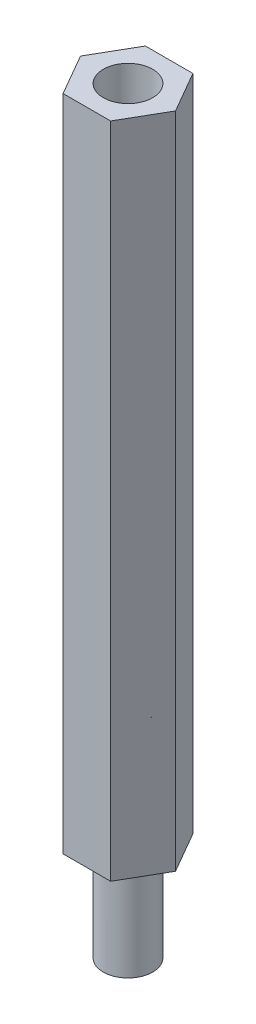
ISO-10303-21;
HEADER;
FILE_DESCRIPTION(('STEP AP214'),'2;1');
FILE_NAME('part.step','',(''),(''),'','','');
FILE_SCHEMA(('AUTOMOTIVE_DESIGN { 1 0 10303 214 1 1 1 1 }'));
ENDSEC;
DATA;
#1=APPLICATION_CONTEXT('core data for automotive mechanical design processes');
#2=APPLICATION_PROTOCOL_DEFINITION('international standard','automotive_design',2000,#1);
#3=PRODUCT_CONTEXT('',#1,'mechanical');
#4=PRODUCT('Part','Part','',(#3));
#5=PRODUCT_RELATED_PRODUCT_CATEGORY('part','',(#4));
#6=PRODUCT_DEFINITION_FORMATION('','',#4);
#7=PRODUCT_DEFINITION_CONTEXT('part definition',#1,'design');
#8=PRODUCT_DEFINITION('design','',#6,#7);
#9=PRODUCT_DEFINITION_SHAPE('','',#8);
#10=(LENGTH_UNIT() NAMED_UNIT(*) SI_UNIT(.MILLI.,.METRE.));
#11=(NAMED_UNIT(*) PLANE_ANGLE_UNIT() SI_UNIT($,.RADIAN.));
#12=(NAMED_UNIT(*) SI_UNIT($,.STERADIAN.) SOLID_ANGLE_UNIT());
#13=UNCERTAINTY_MEASURE_WITH_UNIT(LENGTH_MEASURE(1.E-05),#10,'distance_accuracy_value','');
#14=(GEOMETRIC_REPRESENTATION_CONTEXT(3) GLOBAL_UNCERTAINTY_ASSIGNED_CONTEXT((#13)) GLOBAL_UNIT_ASSIGNED_CONTEXT((#10,
#11,#12)) REPRESENTATION_CONTEXT('',''));
#15=CARTESIAN_POINT('',(0.,0.,0.));
#16=DIRECTION('',(0.,0.,1.));
#17=DIRECTION('',(1.,0.,0.));
#18=AXIS2_PLACEMENT_3D('',#15,#16,#17);
#19=CARTESIAN_POINT('',(-118.553263391177,736.792319552453,160.917570962768));
#20=DIRECTION('',(0.,1.,0.));
#21=DIRECTION('',(0.,0.,-1.));
#22=AXIS2_PLACEMENT_3D('',#19,#20,#21);
#23=CYLINDRICAL_SURFACE('',#22,1.);
#24=CARTESIAN_POINT('',(-118.553263391177,729.292319552453,160.917570962768));
#25=DIRECTION('',(0.,-1.,0.));
#26=DIRECTION('',(0.,0.,-1.));
#27=AXIS2_PLACEMENT_3D('',#24,#25,#26);
#28=CIRCLE('',#27,1.);
#29=CARTESIAN_POINT('',(-118.553263391177,729.292319552453,159.917570962768));
#30=VERTEX_POINT('',#29);
#31=EDGE_CURVE('E201',#30,#30,#28,.F.);
#32=ORIENTED_EDGE('',*,*,#31,.F.);
#33=EDGE_LOOP('',(#32));
#34=FACE_BOUND('',#33,.T.);
#35=CARTESIAN_POINT('',(-118.553263391177,749.292319552453,160.917570962768));
#36=DIRECTION('',(0.,1.,0.));
#37=DIRECTION('',(0.,0.,1.));
#38=AXIS2_PLACEMENT_3D('',#35,#36,#37);
#39=CIRCLE('',#38,1.);
#40=CARTESIAN_POINT('',(-118.553263391177,749.292319552453,161.917570962768));
#41=VERTEX_POINT('',#40);
#42=EDGE_CURVE('E118',#41,#41,#39,.F.);
#43=ORIENTED_EDGE('',*,*,#42,.F.);
#44=EDGE_LOOP('',(#43));
#45=FACE_BOUND('',#44,.T.);
#46=ADVANCED_FACE('F34',(#34,#45),#23,.F.);
#47=CARTESIAN_POINT('',(-117.109887718177,744.292319552453,163.417570962768));
#48=DIRECTION('',(-0.866025403838329,0.,-0.499999999906659));
#49=DIRECTION('',(-0.499999999906659,0.,0.866025403838329));
#50=AXIS2_PLACEMENT_3D('',#47,#48,#49);
#51=PLANE('',#50);
#52=DIRECTION('',(0.500000000006738,0.,-0.866025403780548));
#53=VECTOR('',#52,1.);
#54=CARTESIAN_POINT('',(-117.109887718177,729.292319552453,163.417570962768));
#55=LINE('',#54,#53);
#56=CARTESIAN_POINT('',(-117.109887718177,729.292319552453,163.417570962768));
#57=VERTEX_POINT('',#56);
#58=CARTESIAN_POINT('',(-115.666512045177,729.292319552453,160.917570962768));
#59=VERTEX_POINT('',#58);
#60=EDGE_CURVE('E43',#57,#59,#55,.T.);
#61=ORIENTED_EDGE('',*,*,#60,.T.);
#62=DIRECTION('',(0.,-1.,0.));
#63=VECTOR('',#62,1.);
#64=CARTESIAN_POINT('',(-115.666512045177,744.292319552453,160.917570962768));
#65=LINE('',#64,#63);
#66=CARTESIAN_POINT('',(-115.666512045177,769.292319552453,160.917570962768));
#67=VERTEX_POINT('',#66);
#68=EDGE_CURVE('E51',#67,#59,#65,.T.);
#69=ORIENTED_EDGE('',*,*,#68,.F.);
#70=DIRECTION('',(0.500000000006738,0.,-0.866025403780549));
#71=VECTOR('',#70,1.);
#72=CARTESIAN_POINT('',(-117.109887718177,769.292319552453,163.417570962768));
#73=LINE('',#72,#71);
#74=CARTESIAN_POINT('',(-117.109887718177,769.292319552453,163.417570962768));
#75=VERTEX_POINT('',#74);
#76=EDGE_CURVE('E108',#75,#67,#73,.T.);
#77=ORIENTED_EDGE('',*,*,#76,.F.);
#78=DIRECTION('',(0.,-1.,0.));
#79=VECTOR('',#78,1.);
#80=CARTESIAN_POINT('',(-117.109887718177,744.292319552453,163.417570962768));
#81=LINE('',#80,#79);
#82=EDGE_CURVE('E96',#75,#57,#81,.T.);
#83=ORIENTED_EDGE('',*,*,#82,.T.);
#84=EDGE_LOOP('',(#61,#69,#77,#83));
#85=FACE_BOUND('',#84,.T.);
#86=ADVANCED_FACE('F109',(#85),#51,.F.);
#87=CARTESIAN_POINT('',(-115.666512045177,744.292319552453,160.917570962768));
#88=DIRECTION('',(-0.866025403838329,0.,0.499999999906659));
#89=DIRECTION('',(0.499999999906659,0.,0.866025403838329));
#90=AXIS2_PLACEMENT_3D('',#87,#88,#89);
#91=PLANE('',#90);
#92=DIRECTION('',(-0.500000000006738,0.,-0.866025403780548));
#93=VECTOR('',#92,1.);
#94=CARTESIAN_POINT('',(-115.666512045177,729.292319552453,160.917570962768));
#95=LINE('',#94,#93);
#96=CARTESIAN_POINT('',(-117.109887718177,729.292319552453,158.417570962768));
#97=VERTEX_POINT('',#96);
#98=EDGE_CURVE('E105',#59,#97,#95,.T.);
#99=ORIENTED_EDGE('',*,*,#98,.T.);
#100=DIRECTION('',(0.,-1.,0.));
#101=VECTOR('',#100,1.);
#102=CARTESIAN_POINT('',(-117.109887718177,744.292319552453,158.417570962768));
#103=LINE('',#102,#101);
#104=CARTESIAN_POINT('',(-117.109887718177,769.292319552453,158.417570962768));
#105=VERTEX_POINT('',#104);
#106=EDGE_CURVE('E67',#105,#97,#103,.T.);
#107=ORIENTED_EDGE('',*,*,#106,.F.);
#108=DIRECTION('',(-0.500000000006738,0.,-0.866025403780549));
#109=VECTOR('',#108,1.);
#110=CARTESIAN_POINT('',(-115.666512045177,769.292319552453,160.917570962768));
#111=LINE('',#110,#109);
#112=EDGE_CURVE('E112',#67,#105,#111,.T.);
#113=ORIENTED_EDGE('',*,*,#112,.F.);
#114=ORIENTED_EDGE('',*,*,#68,.T.);
#115=EDGE_LOOP('',(#99,#107,#113,#114));
#116=FACE_BOUND('',#115,.T.);
#117=ADVANCED_FACE('F168',(#116),#91,.F.);
#118=CARTESIAN_POINT('',(-117.109887718177,744.292319552453,158.417570962768));
#119=DIRECTION('',(0.,0.,1.));
#120=DIRECTION('',(1.,0.,0.));
#121=AXIS2_PLACEMENT_3D('',#118,#119,#120);
#122=PLANE('',#121);
#123=DIRECTION('',(-1.,0.,0.));
#124=VECTOR('',#123,1.);
#125=CARTESIAN_POINT('',(-117.109887718177,729.292319552453,158.417570962768));
#126=LINE('',#125,#124);
#127=CARTESIAN_POINT('',(-119.996639064177,729.292319552453,158.417570962768));
#128=VERTEX_POINT('',#127);
#129=EDGE_CURVE('E135',#97,#128,#126,.T.);
#130=ORIENTED_EDGE('',*,*,#129,.T.);
#131=DIRECTION('',(0.,-1.,0.));
#132=VECTOR('',#131,1.);
#133=CARTESIAN_POINT('',(-119.996639064177,744.292319552453,158.417570962768));
#134=LINE('',#133,#132);
#135=CARTESIAN_POINT('',(-119.996639064177,769.292319552453,158.417570962768));
#136=VERTEX_POINT('',#135);
#137=EDGE_CURVE('E73',#136,#128,#134,.T.);
#138=ORIENTED_EDGE('',*,*,#137,.F.);
#139=DIRECTION('',(-1.,0.,0.));
#140=VECTOR('',#139,1.);
#141=CARTESIAN_POINT('',(-117.109887718177,769.292319552453,158.417570962768));
#142=LINE('',#141,#140);
#143=EDGE_CURVE('E127',#105,#136,#142,.T.);
#144=ORIENTED_EDGE('',*,*,#143,.F.);
#145=ORIENTED_EDGE('',*,*,#106,.T.);
#146=EDGE_LOOP('',(#130,#138,#144,#145));
#147=FACE_BOUND('',#146,.T.);
#148=ADVANCED_FACE('F159',(#147),#122,.F.);
#149=CARTESIAN_POINT('',(-119.996639064177,744.292319552453,158.417570962768));
#150=DIRECTION('',(0.866025403838329,0.,0.499999999906659));
#151=DIRECTION('',(0.499999999906659,0.,-0.866025403838329));
#152=AXIS2_PLACEMENT_3D('',#149,#150,#151);
#153=PLANE('',#152);
#154=DIRECTION('',(-0.500000000006738,0.,0.866025403780548));
#155=VECTOR('',#154,1.);
#156=CARTESIAN_POINT('',(-119.996639064177,729.292319552453,158.417570962768));
#157=LINE('',#156,#155);
#158=CARTESIAN_POINT('',(-121.440014737177,729.292319552453,160.917570962768));
#159=VERTEX_POINT('',#158);
#160=EDGE_CURVE('E142',#128,#159,#157,.T.);
#161=ORIENTED_EDGE('',*,*,#160,.T.);
#162=DIRECTION('',(0.,-1.,0.));
#163=VECTOR('',#162,1.);
#164=CARTESIAN_POINT('',(-121.440014737177,744.292319552453,160.917570962768));
#165=LINE('',#164,#163);
#166=CARTESIAN_POINT('',(-121.440014737177,769.292319552453,160.917570962768));
#167=VERTEX_POINT('',#166);
#168=EDGE_CURVE('E79',#167,#159,#165,.T.);
#169=ORIENTED_EDGE('',*,*,#168,.F.);
#170=DIRECTION('',(-0.500000000006738,0.,0.866025403780549));
#171=VECTOR('',#170,1.);
#172=CARTESIAN_POINT('',(-119.996639064177,769.292319552453,158.417570962768));
#173=LINE('',#172,#171);
#174=EDGE_CURVE('E130',#136,#167,#173,.T.);
#175=ORIENTED_EDGE('',*,*,#174,.F.);
#176=ORIENTED_EDGE('',*,*,#137,.T.);
#177=EDGE_LOOP('',(#161,#169,#175,#176));
#178=FACE_BOUND('',#177,.T.);
#179=ADVANCED_FACE('F149',(#178),#153,.F.);
#180=CARTESIAN_POINT('',(-121.440014737177,744.292319552453,160.917570962768));
#181=DIRECTION('',(0.866025403838329,0.,-0.499999999906659));
#182=DIRECTION('',(-0.499999999906659,0.,-0.866025403838329));
#183=AXIS2_PLACEMENT_3D('',#180,#181,#182);
#184=PLANE('',#183);
#185=DIRECTION('',(0.500000000006738,0.,0.866025403780548));
#186=VECTOR('',#185,1.);
#187=CARTESIAN_POINT('',(-121.440014737177,729.292319552453,160.917570962768));
#188=LINE('',#187,#186);
#189=CARTESIAN_POINT('',(-119.996639064177,729.292319552453,163.417570962768));
#190=VERTEX_POINT('',#189);
#191=EDGE_CURVE('E137',#159,#190,#188,.T.);
#192=ORIENTED_EDGE('',*,*,#191,.T.);
#193=DIRECTION('',(0.,-1.,0.));
#194=VECTOR('',#193,1.);
#195=CARTESIAN_POINT('',(-119.996639064177,744.292319552453,163.417570962768));
#196=LINE('',#195,#194);
#197=CARTESIAN_POINT('',(-119.996639064177,769.292319552453,163.417570962768));
#198=VERTEX_POINT('',#197);
#199=EDGE_CURVE('E133',#198,#190,#196,.T.);
#200=ORIENTED_EDGE('',*,*,#199,.F.);
#201=DIRECTION('',(0.500000000006738,0.,0.866025403780549));
#202=VECTOR('',#201,1.);
#203=CARTESIAN_POINT('',(-121.440014737177,769.292319552453,160.917570962768));
#204=LINE('',#203,#202);
#205=EDGE_CURVE('E117',#167,#198,#204,.T.);
#206=ORIENTED_EDGE('',*,*,#205,.F.);
#207=ORIENTED_EDGE('',*,*,#168,.T.);
#208=EDGE_LOOP('',(#192,#200,#206,#207));
#209=FACE_BOUND('',#208,.T.);
#210=ADVANCED_FACE('F152',(#209),#184,.F.);
#211=CARTESIAN_POINT('',(-119.996639064177,744.292319552453,163.417570962768));
#212=DIRECTION('',(0.,0.,-1.));
#213=DIRECTION('',(-1.,0.,0.));
#214=AXIS2_PLACEMENT_3D('',#211,#212,#213);
#215=PLANE('',#214);
#216=DIRECTION('',(1.,0.,0.));
#217=VECTOR('',#216,1.);
#218=CARTESIAN_POINT('',(-119.996639064177,729.292319552453,163.417570962768));
#219=LINE('',#218,#217);
#220=EDGE_CURVE('E102',#190,#57,#219,.T.);
#221=ORIENTED_EDGE('',*,*,#220,.T.);
#222=ORIENTED_EDGE('',*,*,#82,.F.);
#223=DIRECTION('',(1.,0.,0.));
#224=VECTOR('',#223,1.);
#225=CARTESIAN_POINT('',(-119.996639064177,769.292319552453,163.417570962768));
#226=LINE('',#225,#224);
#227=EDGE_CURVE('E100',#198,#75,#226,.T.);
#228=ORIENTED_EDGE('',*,*,#227,.F.);
#229=ORIENTED_EDGE('',*,*,#199,.T.);
#230=EDGE_LOOP('',(#221,#222,#228,#229));
#231=FACE_BOUND('',#230,.T.);
#232=ADVANCED_FACE('F98',(#231),#215,.F.);
#233=CARTESIAN_POINT('',(-118.553263391177,729.292319552453,160.917570962768));
#234=DIRECTION('',(0.,1.,0.));
#235=DIRECTION('',(0.,0.,1.));
#236=AXIS2_PLACEMENT_3D('',#233,#234,#235);
#237=PLANE('',#236);
#238=CARTESIAN_POINT('',(-118.553263391177,729.292319552453,160.917570962768));
#239=DIRECTION('',(0.,1.,0.));
#240=DIRECTION('',(0.,0.,1.));
#241=AXIS2_PLACEMENT_3D('',#238,#239,#240);
#242=CIRCLE('',#241,1.5);
#243=CARTESIAN_POINT('',(-118.553263391177,729.292319552453,162.417570962768));
#244=VERTEX_POINT('',#243);
#245=EDGE_CURVE('E11',#244,#244,#242,.F.);
#246=ORIENTED_EDGE('',*,*,#245,.F.);
#247=EDGE_LOOP('',(#246));
#248=FACE_BOUND('',#247,.T.);
#249=ORIENTED_EDGE('',*,*,#60,.F.);
#250=ORIENTED_EDGE('',*,*,#220,.F.);
#251=ORIENTED_EDGE('',*,*,#191,.F.);
#252=ORIENTED_EDGE('',*,*,#160,.F.);
#253=ORIENTED_EDGE('',*,*,#129,.F.);
#254=ORIENTED_EDGE('',*,*,#98,.F.);
#255=EDGE_LOOP('',(#249,#250,#251,#252,#253,#254));
#256=FACE_BOUND('',#255,.T.);
#257=ADVANCED_FACE('F36',(#248,#256),#237,.F.);
#258=CARTESIAN_POINT('',(0.,769.292319552453,0.));
#259=DIRECTION('',(0.,1.,0.));
#260=DIRECTION('',(0.,0.,1.));
#261=AXIS2_PLACEMENT_3D('',#258,#259,#260);
#262=PLANE('',#261);
#263=CARTESIAN_POINT('',(-118.553263391177,769.292319552453,160.917570962768));
#264=DIRECTION('',(0.,1.,0.));
#265=DIRECTION('',(0.,0.,1.));
#266=AXIS2_PLACEMENT_3D('',#263,#264,#265);
#267=CIRCLE('',#266,1.5);
#268=CARTESIAN_POINT('',(-118.553263391177,769.292319552453,162.417570962768));
#269=VERTEX_POINT('',#268);
#270=EDGE_CURVE('E123',#269,#269,#267,.T.);
#271=ORIENTED_EDGE('',*,*,#270,.F.);
#272=EDGE_LOOP('',(#271));
#273=FACE_BOUND('',#272,.T.);
#274=ORIENTED_EDGE('',*,*,#227,.T.);
#275=ORIENTED_EDGE('',*,*,#76,.T.);
#276=ORIENTED_EDGE('',*,*,#112,.T.);
#277=ORIENTED_EDGE('',*,*,#143,.T.);
#278=ORIENTED_EDGE('',*,*,#174,.T.);
#279=ORIENTED_EDGE('',*,*,#205,.T.);
#280=EDGE_LOOP('',(#274,#275,#276,#277,#278,#279));
#281=FACE_BOUND('',#280,.T.);
#282=ADVANCED_FACE('F115',(#273,#281),#262,.T.);
#283=CARTESIAN_POINT('',(-118.553263391177,749.292319552453,160.917570962768));
#284=DIRECTION('',(0.,1.,0.));
#285=DIRECTION('',(0.,0.,1.));
#286=AXIS2_PLACEMENT_3D('',#283,#284,#285);
#287=PLANE('',#286);
#288=CARTESIAN_POINT('',(-118.553263391177,749.292319552453,160.917570962768));
#289=DIRECTION('',(0.,1.,0.));
#290=DIRECTION('',(0.,0.,1.));
#291=AXIS2_PLACEMENT_3D('',#288,#289,#290);
#292=CIRCLE('',#291,1.5);
#293=CARTESIAN_POINT('',(-118.553263391177,749.292319552453,162.417570962768));
#294=VERTEX_POINT('',#293);
#295=EDGE_CURVE('E121',#294,#294,#292,.T.);
#296=ORIENTED_EDGE('',*,*,#295,.T.);
#297=EDGE_LOOP('',(#296));
#298=FACE_BOUND('',#297,.T.);
#299=ORIENTED_EDGE('',*,*,#42,.T.);
#300=EDGE_LOOP('',(#299));
#301=FACE_BOUND('',#300,.T.);
#302=ADVANCED_FACE('F176',(#298,#301),#287,.T.);
#303=CARTESIAN_POINT('',(-118.553263391177,749.292319552453,160.917570962768));
#304=DIRECTION('',(0.,1.,0.));
#305=DIRECTION('',(0.,0.,1.));
#306=AXIS2_PLACEMENT_3D('',#303,#304,#305);
#307=CYLINDRICAL_SURFACE('',#306,1.5);
#308=ORIENTED_EDGE('',*,*,#295,.F.);
#309=EDGE_LOOP('',(#308));
#310=FACE_BOUND('',#309,.T.);
#311=ORIENTED_EDGE('',*,*,#270,.T.);
#312=EDGE_LOOP('',(#311));
#313=FACE_BOUND('',#312,.T.);
#314=ADVANCED_FACE('F178',(#310,#313),#307,.F.);
#315=CARTESIAN_POINT('',(-118.553263391177,723.292319552453,160.917570962768));
#316=DIRECTION('',(0.,-1.,0.));
#317=DIRECTION('',(0.,0.,-1.));
#318=AXIS2_PLACEMENT_3D('',#315,#316,#317);
#319=PLANE('',#318);
#320=CARTESIAN_POINT('',(-118.553263391177,723.292319552453,160.917570962768));
#321=DIRECTION('',(0.,-1.,0.));
#322=DIRECTION('',(0.,0.,-1.));
#323=AXIS2_PLACEMENT_3D('',#320,#321,#322);
#324=CIRCLE('',#323,1.5);
#325=CARTESIAN_POINT('',(-118.553263391177,723.292319552453,159.417570962768));
#326=VERTEX_POINT('',#325);
#327=EDGE_CURVE('E200',#326,#326,#324,.T.);
#328=ORIENTED_EDGE('',*,*,#327,.T.);
#329=EDGE_LOOP('',(#328));
#330=FACE_BOUND('',#329,.T.);
#331=ADVANCED_FACE('F181',(#330),#319,.T.);
#332=CARTESIAN_POINT('',(-118.553263391177,723.292319552453,160.917570962768));
#333=DIRECTION('',(0.,1.,0.));
#334=DIRECTION('',(0.,0.,1.));
#335=AXIS2_PLACEMENT_3D('',#332,#333,#334);
#336=CYLINDRICAL_SURFACE('',#335,1.5);
#337=ORIENTED_EDGE('',*,*,#327,.F.);
#338=EDGE_LOOP('',(#337));
#339=FACE_BOUND('',#338,.T.);
#340=ORIENTED_EDGE('',*,*,#245,.T.);
#341=EDGE_LOOP('',(#340));
#342=FACE_BOUND('',#341,.T.);
#343=ADVANCED_FACE('F186',(#339,#342),#336,.T.);
#344=CARTESIAN_POINT('',(-118.553263391177,729.292319552453,160.917570962768));
#345=DIRECTION('',(0.,-1.,0.));
#346=DIRECTION('',(0.,0.,-1.));
#347=AXIS2_PLACEMENT_3D('',#344,#345,#346);
#348=PLANE('',#347);
#349=ORIENTED_EDGE('',*,*,#31,.T.);
#350=EDGE_LOOP('',(#349));
#351=FACE_BOUND('',#350,.T.);
#352=ADVANCED_FACE('F189',(#351),#348,.F.);
#353=CLOSED_SHELL('',(#46,#86,#117,#148,#179,#210,#232,#257,#282,#302,#314,#331,#343,#352));
#354=MANIFOLD_SOLID_BREP('B2',#353);
#355=ADVANCED_BREP_SHAPE_REPRESENTATION('',(#18,#354),#14);
#356=SHAPE_DEFINITION_REPRESENTATION(#9,#355);
ENDSEC;
END-ISO-10303-21;
